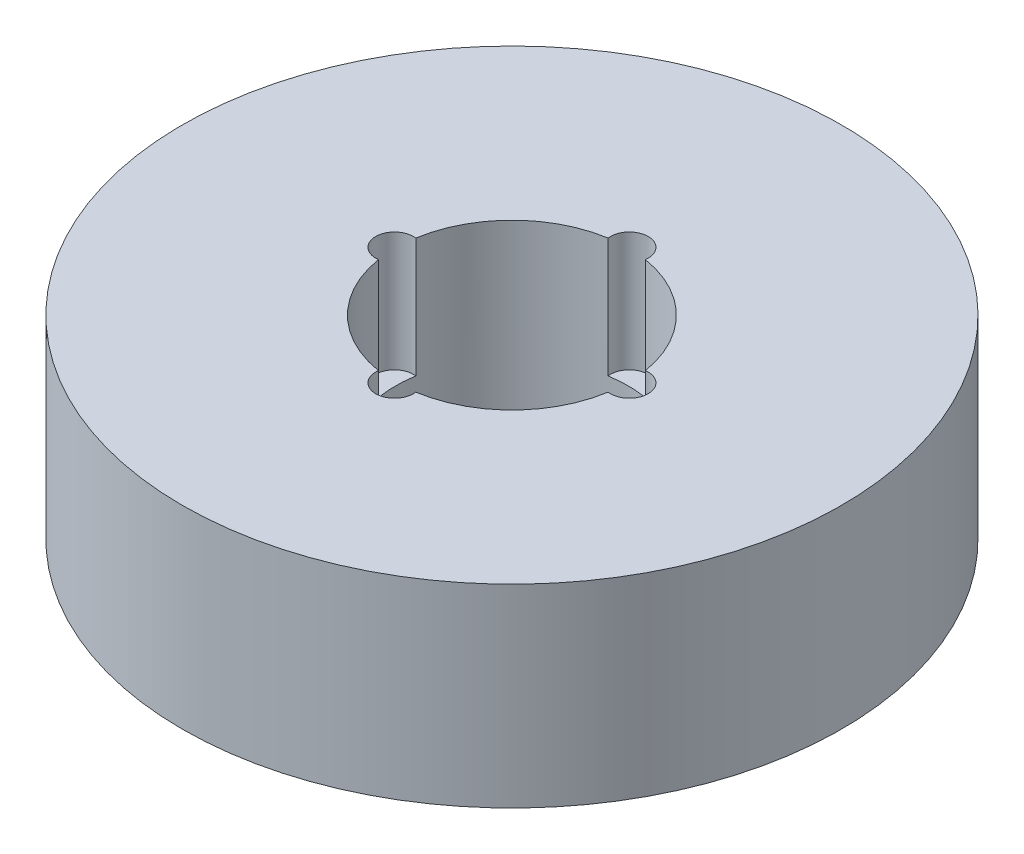
ISO-10303-21;
HEADER;
FILE_DESCRIPTION(('STEP AP214'),'2;1');
FILE_NAME('part.step','',(''),(''),'','','');
FILE_SCHEMA(('AUTOMOTIVE_DESIGN { 1 0 10303 214 1 1 1 1 }'));
ENDSEC;
DATA;
#1=APPLICATION_CONTEXT('core data for automotive mechanical design processes');
#2=APPLICATION_PROTOCOL_DEFINITION('international standard','automotive_design',2000,#1);
#3=PRODUCT_CONTEXT('',#1,'mechanical');
#4=PRODUCT('Part','Part','',(#3));
#5=PRODUCT_RELATED_PRODUCT_CATEGORY('part','',(#4));
#6=PRODUCT_DEFINITION_FORMATION('','',#4);
#7=PRODUCT_DEFINITION_CONTEXT('part definition',#1,'design');
#8=PRODUCT_DEFINITION('design','',#6,#7);
#9=PRODUCT_DEFINITION_SHAPE('','',#8);
#10=(LENGTH_UNIT() NAMED_UNIT(*) SI_UNIT(.MILLI.,.METRE.));
#11=(NAMED_UNIT(*) PLANE_ANGLE_UNIT() SI_UNIT($,.RADIAN.));
#12=(NAMED_UNIT(*) SI_UNIT($,.STERADIAN.) SOLID_ANGLE_UNIT());
#13=UNCERTAINTY_MEASURE_WITH_UNIT(LENGTH_MEASURE(1.E-05),#10,'distance_accuracy_value','');
#14=(GEOMETRIC_REPRESENTATION_CONTEXT(3) GLOBAL_UNCERTAINTY_ASSIGNED_CONTEXT((#13)) GLOBAL_UNIT_ASSIGNED_CONTEXT((#10,
#11,#12)) REPRESENTATION_CONTEXT('',''));
#15=CARTESIAN_POINT('',(0.,0.,0.));
#16=DIRECTION('',(0.,0.,1.));
#17=DIRECTION('',(1.,0.,0.));
#18=AXIS2_PLACEMENT_3D('',#15,#16,#17);
#19=CARTESIAN_POINT('',(0.,25.,0.));
#20=DIRECTION('',(0.,-1.,0.));
#21=DIRECTION('',(0.,0.,-1.));
#22=AXIS2_PLACEMENT_3D('',#19,#20,#21);
#23=CYLINDRICAL_SURFACE('',#22,42.5);
#24=CARTESIAN_POINT('',(0.,25.,0.));
#25=DIRECTION('',(0.,1.,0.));
#26=DIRECTION('',(0.,0.,1.));
#27=AXIS2_PLACEMENT_3D('',#24,#25,#26);
#28=CIRCLE('',#27,42.5);
#29=CARTESIAN_POINT('',(0.,25.,42.5));
#30=VERTEX_POINT('',#29);
#31=EDGE_CURVE('E145',#30,#30,#28,.T.);
#32=ORIENTED_EDGE('',*,*,#31,.F.);
#33=EDGE_LOOP('',(#32));
#34=FACE_BOUND('',#33,.T.);
#35=CARTESIAN_POINT('',(0.,0.,0.));
#36=DIRECTION('',(0.,1.,0.));
#37=DIRECTION('',(0.,0.,1.));
#38=AXIS2_PLACEMENT_3D('',#35,#36,#37);
#39=CIRCLE('',#38,42.5);
#40=CARTESIAN_POINT('',(0.,0.,42.5));
#41=VERTEX_POINT('',#40);
#42=EDGE_CURVE('E143',#41,#41,#39,.T.);
#43=ORIENTED_EDGE('',*,*,#42,.T.);
#44=EDGE_LOOP('',(#43));
#45=FACE_BOUND('',#44,.T.);
#46=ADVANCED_FACE('F39',(#34,#45),#23,.T.);
#47=CARTESIAN_POINT('',(0.,25.,0.));
#48=DIRECTION('',(0.,1.,0.));
#49=DIRECTION('',(0.,0.,1.));
#50=AXIS2_PLACEMENT_3D('',#47,#48,#49);
#51=PLANE('',#50);
#52=CARTESIAN_POINT('',(0.,25.,15.1402923271988));
#53=DIRECTION('',(0.,1.,0.));
#54=DIRECTION('',(1.,0.,0.));
#55=AXIS2_PLACEMENT_3D('',#52,#53,#54);
#56=CIRCLE('',#55,2.42689380584157);
#57=CARTESIAN_POINT('',(-2.40377976262203,25.,14.8061420651299));
#58=VERTEX_POINT('',#57);
#59=CARTESIAN_POINT('',(2.40377976262214,25.,14.8061420651299));
#60=VERTEX_POINT('',#59);
#61=EDGE_CURVE('E152',#58,#60,#56,.T.);
#62=ORIENTED_EDGE('',*,*,#61,.F.);
#63=CARTESIAN_POINT('',(0.,25.,0.));
#64=DIRECTION('',(0.,1.,0.));
#65=DIRECTION('',(0.,0.,1.));
#66=AXIS2_PLACEMENT_3D('',#63,#64,#65);
#67=CIRCLE('',#66,15.);
#68=CARTESIAN_POINT('',(-14.8061420651299,25.,2.40377976262208));
#69=VERTEX_POINT('',#68);
#70=EDGE_CURVE('E133',#69,#58,#67,.T.);
#71=ORIENTED_EDGE('',*,*,#70,.F.);
#72=CARTESIAN_POINT('',(-15.1402923271988,25.,0.));
#73=DIRECTION('',(0.,1.,0.));
#74=DIRECTION('',(0.,0.,1.));
#75=AXIS2_PLACEMENT_3D('',#72,#73,#74);
#76=CIRCLE('',#75,2.42689380584157);
#77=CARTESIAN_POINT('',(-14.8061420651299,25.,-2.40377976262208));
#78=VERTEX_POINT('',#77);
#79=EDGE_CURVE('E128',#78,#69,#76,.T.);
#80=ORIENTED_EDGE('',*,*,#79,.F.);
#81=CARTESIAN_POINT('',(-2.40377976262224,25.,-14.8061420651299));
#82=VERTEX_POINT('',#81);
#83=EDGE_CURVE('E121',#82,#78,#67,.T.);
#84=ORIENTED_EDGE('',*,*,#83,.F.);
#85=CARTESIAN_POINT('',(-1.58586144375133E-13,25.,-15.1402923271988));
#86=DIRECTION('',(0.,1.,0.));
#87=DIRECTION('',(-1.,0.,0.));
#88=AXIS2_PLACEMENT_3D('',#85,#86,#87);
#89=CIRCLE('',#88,2.42689380584157);
#90=CARTESIAN_POINT('',(2.40377976262193,25.,-14.8061420651299));
#91=VERTEX_POINT('',#90);
#92=EDGE_CURVE('E105',#91,#82,#89,.T.);
#93=ORIENTED_EDGE('',*,*,#92,.F.);
#94=CARTESIAN_POINT('',(14.8061420651299,25.,-2.40377976262208));
#95=VERTEX_POINT('',#94);
#96=EDGE_CURVE('E131',#95,#91,#67,.T.);
#97=ORIENTED_EDGE('',*,*,#96,.F.);
#98=CARTESIAN_POINT('',(15.1402923271988,25.,0.));
#99=DIRECTION('',(0.,1.,0.));
#100=DIRECTION('',(0.,0.,-1.));
#101=AXIS2_PLACEMENT_3D('',#98,#99,#100);
#102=CIRCLE('',#101,2.42689380584157);
#103=CARTESIAN_POINT('',(14.8061420651299,25.,2.40377976262208));
#104=VERTEX_POINT('',#103);
#105=EDGE_CURVE('E154',#104,#95,#102,.T.);
#106=ORIENTED_EDGE('',*,*,#105,.F.);
#107=EDGE_CURVE('E134',#60,#104,#67,.T.);
#108=ORIENTED_EDGE('',*,*,#107,.F.);
#109=EDGE_LOOP('',(#62,#71,#80,#84,#93,#97,#106,#108));
#110=FACE_BOUND('',#109,.T.);
#111=ORIENTED_EDGE('',*,*,#31,.T.);
#112=EDGE_LOOP('',(#111));
#113=FACE_BOUND('',#112,.T.);
#114=ADVANCED_FACE('F130',(#110,#113),#51,.T.);
#115=CARTESIAN_POINT('',(0.,0.,0.));
#116=DIRECTION('',(0.,1.,0.));
#117=DIRECTION('',(0.,0.,1.));
#118=AXIS2_PLACEMENT_3D('',#115,#116,#117);
#119=PLANE('',#118);
#120=CARTESIAN_POINT('',(0.,0.,0.));
#121=DIRECTION('',(0.,1.,0.));
#122=DIRECTION('',(0.,0.,1.));
#123=AXIS2_PLACEMENT_3D('',#120,#121,#122);
#124=CIRCLE('',#123,15.);
#125=CARTESIAN_POINT('',(0.,0.,15.));
#126=VERTEX_POINT('',#125);
#127=EDGE_CURVE('E135',#126,#126,#124,.T.);
#128=ORIENTED_EDGE('',*,*,#127,.T.);
#129=EDGE_LOOP('',(#128));
#130=FACE_BOUND('',#129,.T.);
#131=ORIENTED_EDGE('',*,*,#42,.F.);
#132=EDGE_LOOP('',(#131));
#133=FACE_BOUND('',#132,.T.);
#134=ADVANCED_FACE('F195',(#130,#133),#119,.F.);
#135=CARTESIAN_POINT('',(0.,25.,0.));
#136=DIRECTION('',(0.,-1.,0.));
#137=DIRECTION('',(0.,0.,-1.));
#138=AXIS2_PLACEMENT_3D('',#135,#136,#137);
#139=CYLINDRICAL_SURFACE('',#138,15.);
#140=DIRECTION('',(0.,1.,0.));
#141=VECTOR('',#140,1.);
#142=CARTESIAN_POINT('',(-2.40377976262203,17.30191085218,14.8061420651299));
#143=LINE('',#142,#141);
#144=CARTESIAN_POINT('',(-2.40377976262203,9.60382170436006,14.8061420651299));
#145=VERTEX_POINT('',#144);
#146=EDGE_CURVE('E11',#145,#58,#143,.T.);
#147=ORIENTED_EDGE('',*,*,#146,.F.);
#148=CARTESIAN_POINT('',(0.,9.60382170436006,0.));
#149=DIRECTION('',(0.,1.,0.));
#150=DIRECTION('',(0.,0.,1.));
#151=AXIS2_PLACEMENT_3D('',#148,#149,#150);
#152=CIRCLE('',#151,15.);
#153=CARTESIAN_POINT('',(2.40377976262214,9.60382170436006,14.8061420651299));
#154=VERTEX_POINT('',#153);
#155=EDGE_CURVE('E169',#145,#154,#152,.T.);
#156=ORIENTED_EDGE('',*,*,#155,.T.);
#157=DIRECTION('',(0.,1.,0.));
#158=VECTOR('',#157,1.);
#159=CARTESIAN_POINT('',(2.40377976262214,17.30191085218,14.8061420651299));
#160=LINE('',#159,#158);
#161=EDGE_CURVE('E46',#60,#154,#160,.F.);
#162=ORIENTED_EDGE('',*,*,#161,.F.);
#163=ORIENTED_EDGE('',*,*,#107,.T.);
#164=DIRECTION('',(0.,1.,0.));
#165=VECTOR('',#164,1.);
#166=CARTESIAN_POINT('',(14.8061420651299,17.30191085218,2.40377976262208));
#167=LINE('',#166,#165);
#168=CARTESIAN_POINT('',(14.8061420651299,9.60382170436006,2.40377976262208));
#169=VERTEX_POINT('',#168);
#170=EDGE_CURVE('E151',#169,#104,#167,.T.);
#171=ORIENTED_EDGE('',*,*,#170,.F.);
#172=CARTESIAN_POINT('',(0.,9.60382170436006,0.));
#173=DIRECTION('',(0.,1.,0.));
#174=DIRECTION('',(0.,0.,1.));
#175=AXIS2_PLACEMENT_3D('',#172,#173,#174);
#176=CIRCLE('',#175,15.);
#177=CARTESIAN_POINT('',(14.8061420651299,9.60382170436006,-2.40377976262208));
#178=VERTEX_POINT('',#177);
#179=EDGE_CURVE('E173',#169,#178,#176,.T.);
#180=ORIENTED_EDGE('',*,*,#179,.T.);
#181=DIRECTION('',(0.,1.,0.));
#182=VECTOR('',#181,1.);
#183=CARTESIAN_POINT('',(14.8061420651299,17.30191085218,-2.40377976262208));
#184=LINE('',#183,#182);
#185=EDGE_CURVE('E168',#95,#178,#184,.F.);
#186=ORIENTED_EDGE('',*,*,#185,.F.);
#187=ORIENTED_EDGE('',*,*,#96,.T.);
#188=DIRECTION('',(0.,1.,0.));
#189=VECTOR('',#188,1.);
#190=CARTESIAN_POINT('',(2.40377976262193,17.30191085218,-14.8061420651299));
#191=LINE('',#190,#189);
#192=CARTESIAN_POINT('',(2.40377976262193,9.60382170436006,-14.8061420651299));
#193=VERTEX_POINT('',#192);
#194=EDGE_CURVE('E108',#193,#91,#191,.T.);
#195=ORIENTED_EDGE('',*,*,#194,.F.);
#196=CARTESIAN_POINT('',(0.,9.60382170436006,0.));
#197=DIRECTION('',(0.,1.,0.));
#198=DIRECTION('',(0.,0.,1.));
#199=AXIS2_PLACEMENT_3D('',#196,#197,#198);
#200=CIRCLE('',#199,15.);
#201=CARTESIAN_POINT('',(-2.40377976262224,9.60382170436006,-14.8061420651299));
#202=VERTEX_POINT('',#201);
#203=EDGE_CURVE('E122',#193,#202,#200,.T.);
#204=ORIENTED_EDGE('',*,*,#203,.T.);
#205=DIRECTION('',(0.,1.,0.));
#206=VECTOR('',#205,1.);
#207=CARTESIAN_POINT('',(-2.40377976262224,17.30191085218,-14.8061420651299));
#208=LINE('',#207,#206);
#209=EDGE_CURVE('E106',#82,#202,#208,.F.);
#210=ORIENTED_EDGE('',*,*,#209,.F.);
#211=ORIENTED_EDGE('',*,*,#83,.T.);
#212=DIRECTION('',(0.,1.,0.));
#213=VECTOR('',#212,1.);
#214=CARTESIAN_POINT('',(-14.8061420651299,17.30191085218,-2.40377976262208));
#215=LINE('',#214,#213);
#216=CARTESIAN_POINT('',(-14.8061420651299,9.60382170436006,-2.40377976262208));
#217=VERTEX_POINT('',#216);
#218=EDGE_CURVE('E177',#217,#78,#215,.T.);
#219=ORIENTED_EDGE('',*,*,#218,.F.);
#220=CARTESIAN_POINT('',(0.,9.60382170436006,0.));
#221=DIRECTION('',(0.,1.,0.));
#222=DIRECTION('',(0.,0.,1.));
#223=AXIS2_PLACEMENT_3D('',#220,#221,#222);
#224=CIRCLE('',#223,15.);
#225=CARTESIAN_POINT('',(-14.8061420651299,9.60382170436006,2.40377976262208));
#226=VERTEX_POINT('',#225);
#227=EDGE_CURVE('E185',#217,#226,#224,.T.);
#228=ORIENTED_EDGE('',*,*,#227,.T.);
#229=DIRECTION('',(0.,1.,0.));
#230=VECTOR('',#229,1.);
#231=CARTESIAN_POINT('',(-14.8061420651299,17.30191085218,2.40377976262208));
#232=LINE('',#231,#230);
#233=EDGE_CURVE('E179',#69,#226,#232,.F.);
#234=ORIENTED_EDGE('',*,*,#233,.F.);
#235=ORIENTED_EDGE('',*,*,#70,.T.);
#236=EDGE_LOOP('',(#147,#156,#162,#163,#171,#180,#186,#187,#195,#204,#210,#211,#219,#228,#234,#235));
#237=FACE_BOUND('',#236,.T.);
#238=ORIENTED_EDGE('',*,*,#127,.F.);
#239=EDGE_LOOP('',(#238));
#240=FACE_BOUND('',#239,.T.);
#241=ADVANCED_FACE('F117',(#237,#240),#139,.F.);
#242=CARTESIAN_POINT('',(-15.1402923271988,9.60382170436006,0.));
#243=DIRECTION('',(0.,1.,0.));
#244=DIRECTION('',(0.,0.,1.));
#245=AXIS2_PLACEMENT_3D('',#242,#243,#244);
#246=CYLINDRICAL_SURFACE('',#245,2.42689380584157);
#247=ORIENTED_EDGE('',*,*,#218,.T.);
#248=ORIENTED_EDGE('',*,*,#79,.T.);
#249=ORIENTED_EDGE('',*,*,#233,.T.);
#250=CARTESIAN_POINT('',(-15.1402923271988,9.60382170436006,0.));
#251=DIRECTION('',(0.,1.,0.));
#252=DIRECTION('',(0.,0.,1.));
#253=AXIS2_PLACEMENT_3D('',#250,#251,#252);
#254=CIRCLE('',#253,2.42689380584157);
#255=EDGE_CURVE('E140',#217,#226,#254,.T.);
#256=ORIENTED_EDGE('',*,*,#255,.F.);
#257=EDGE_LOOP('',(#247,#248,#249,#256));
#258=FACE_BOUND('',#257,.T.);
#259=ADVANCED_FACE('F200',(#258),#246,.F.);
#260=CARTESIAN_POINT('',(-15.1402923271988,9.60382170436006,0.));
#261=DIRECTION('',(0.,1.,0.));
#262=DIRECTION('',(0.,0.,1.));
#263=AXIS2_PLACEMENT_3D('',#260,#261,#262);
#264=PLANE('',#263);
#265=ORIENTED_EDGE('',*,*,#255,.T.);
#266=ORIENTED_EDGE('',*,*,#227,.F.);
#267=EDGE_LOOP('',(#265,#266));
#268=FACE_BOUND('',#267,.T.);
#269=ADVANCED_FACE('F202',(#268),#264,.T.);
#270=CARTESIAN_POINT('',(-1.58586144375133E-13,9.60382170436006,-15.1402923271988));
#271=DIRECTION('',(0.,1.,0.));
#272=DIRECTION('',(0.,0.,1.));
#273=AXIS2_PLACEMENT_3D('',#270,#271,#272);
#274=CYLINDRICAL_SURFACE('',#273,2.42689380584157);
#275=ORIENTED_EDGE('',*,*,#194,.T.);
#276=ORIENTED_EDGE('',*,*,#92,.T.);
#277=ORIENTED_EDGE('',*,*,#209,.T.);
#278=CARTESIAN_POINT('',(-1.58586144375133E-13,9.60382170436006,-15.1402923271988));
#279=DIRECTION('',(0.,1.,0.));
#280=DIRECTION('',(-1.,0.,0.));
#281=AXIS2_PLACEMENT_3D('',#278,#279,#280);
#282=CIRCLE('',#281,2.42689380584157);
#283=EDGE_CURVE('E111',#193,#202,#282,.T.);
#284=ORIENTED_EDGE('',*,*,#283,.F.);
#285=EDGE_LOOP('',(#275,#276,#277,#284));
#286=FACE_BOUND('',#285,.T.);
#287=ADVANCED_FACE('F102',(#286),#274,.F.);
#288=CARTESIAN_POINT('',(-1.58586144375133E-13,9.60382170436006,-15.1402923271988));
#289=DIRECTION('',(0.,1.,0.));
#290=DIRECTION('',(-1.,0.,0.));
#291=AXIS2_PLACEMENT_3D('',#288,#289,#290);
#292=PLANE('',#291);
#293=ORIENTED_EDGE('',*,*,#283,.T.);
#294=ORIENTED_EDGE('',*,*,#203,.F.);
#295=EDGE_LOOP('',(#293,#294));
#296=FACE_BOUND('',#295,.T.);
#297=ADVANCED_FACE('F211',(#296),#292,.T.);
#298=CARTESIAN_POINT('',(15.1402923271988,9.60382170436006,0.));
#299=DIRECTION('',(0.,1.,0.));
#300=DIRECTION('',(0.,0.,1.));
#301=AXIS2_PLACEMENT_3D('',#298,#299,#300);
#302=CYLINDRICAL_SURFACE('',#301,2.42689380584157);
#303=ORIENTED_EDGE('',*,*,#170,.T.);
#304=ORIENTED_EDGE('',*,*,#105,.T.);
#305=ORIENTED_EDGE('',*,*,#185,.T.);
#306=CARTESIAN_POINT('',(15.1402923271988,9.60382170436006,0.));
#307=DIRECTION('',(0.,1.,0.));
#308=DIRECTION('',(0.,0.,-1.));
#309=AXIS2_PLACEMENT_3D('',#306,#307,#308);
#310=CIRCLE('',#309,2.42689380584157);
#311=EDGE_CURVE('E56',#169,#178,#310,.T.);
#312=ORIENTED_EDGE('',*,*,#311,.F.);
#313=EDGE_LOOP('',(#303,#304,#305,#312));
#314=FACE_BOUND('',#313,.T.);
#315=ADVANCED_FACE('F212',(#314),#302,.F.);
#316=CARTESIAN_POINT('',(15.1402923271988,9.60382170436006,0.));
#317=DIRECTION('',(0.,1.,0.));
#318=DIRECTION('',(0.,0.,-1.));
#319=AXIS2_PLACEMENT_3D('',#316,#317,#318);
#320=PLANE('',#319);
#321=ORIENTED_EDGE('',*,*,#311,.T.);
#322=ORIENTED_EDGE('',*,*,#179,.F.);
#323=EDGE_LOOP('',(#321,#322));
#324=FACE_BOUND('',#323,.T.);
#325=ADVANCED_FACE('F217',(#324),#320,.T.);
#326=CARTESIAN_POINT('',(0.,9.60382170436006,15.1402923271988));
#327=DIRECTION('',(0.,1.,0.));
#328=DIRECTION('',(0.,0.,1.));
#329=AXIS2_PLACEMENT_3D('',#326,#327,#328);
#330=CYLINDRICAL_SURFACE('',#329,2.42689380584157);
#331=ORIENTED_EDGE('',*,*,#146,.T.);
#332=ORIENTED_EDGE('',*,*,#61,.T.);
#333=ORIENTED_EDGE('',*,*,#161,.T.);
#334=CARTESIAN_POINT('',(0.,9.60382170436006,15.1402923271988));
#335=DIRECTION('',(0.,1.,0.));
#336=DIRECTION('',(1.,0.,0.));
#337=AXIS2_PLACEMENT_3D('',#334,#335,#336);
#338=CIRCLE('',#337,2.42689380584157);
#339=EDGE_CURVE('E55',#145,#154,#338,.T.);
#340=ORIENTED_EDGE('',*,*,#339,.F.);
#341=EDGE_LOOP('',(#331,#332,#333,#340));
#342=FACE_BOUND('',#341,.T.);
#343=ADVANCED_FACE('F170',(#342),#330,.F.);
#344=CARTESIAN_POINT('',(0.,9.60382170436006,15.1402923271988));
#345=DIRECTION('',(0.,1.,0.));
#346=DIRECTION('',(1.,0.,0.));
#347=AXIS2_PLACEMENT_3D('',#344,#345,#346);
#348=PLANE('',#347);
#349=ORIENTED_EDGE('',*,*,#339,.T.);
#350=ORIENTED_EDGE('',*,*,#155,.F.);
#351=EDGE_LOOP('',(#349,#350));
#352=FACE_BOUND('',#351,.T.);
#353=ADVANCED_FACE('F224',(#352),#348,.T.);
#354=CLOSED_SHELL('',(#46,#114,#134,#241,#259,#269,#287,#297,#315,#325,#343,#353));
#355=MANIFOLD_SOLID_BREP('B2',#354);
#356=ADVANCED_BREP_SHAPE_REPRESENTATION('',(#18,#355),#14);
#357=SHAPE_DEFINITION_REPRESENTATION(#9,#356);
ENDSEC;
END-ISO-10303-21;
